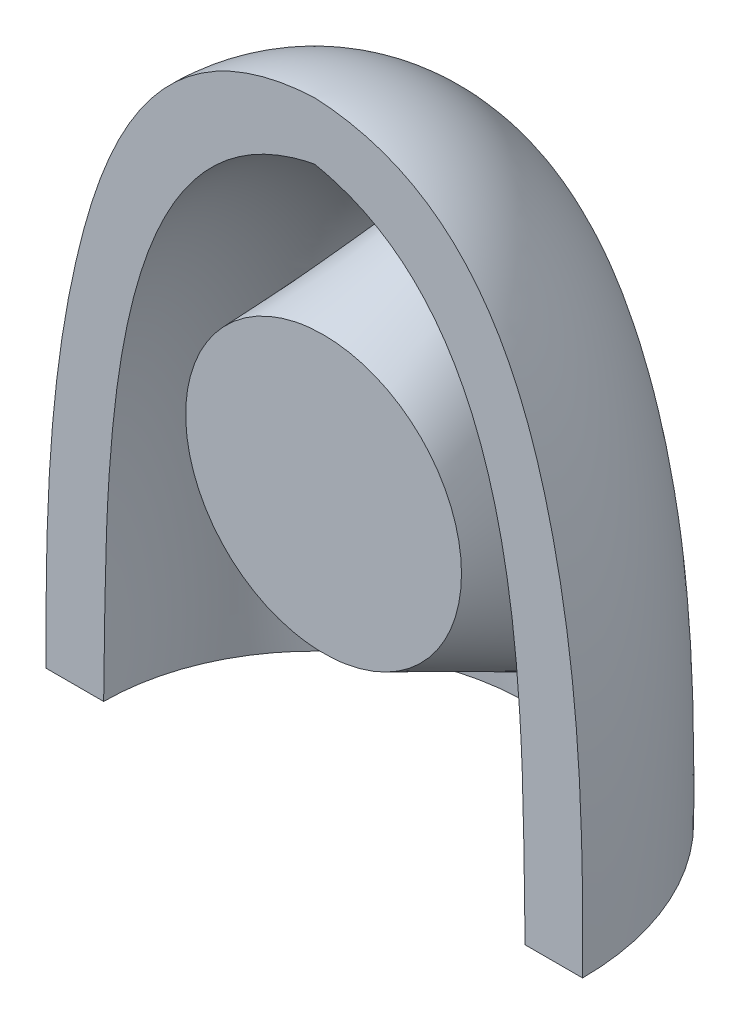
ISO-10303-21;
HEADER;
FILE_DESCRIPTION(('STEP AP214'),'2;1');
FILE_NAME('part.step','',(''),(''),'','','');
FILE_SCHEMA(('AUTOMOTIVE_DESIGN { 1 0 10303 214 1 1 1 1 }'));
ENDSEC;
DATA;
#1=APPLICATION_CONTEXT('core data for automotive mechanical design processes');
#2=APPLICATION_PROTOCOL_DEFINITION('international standard','automotive_design',2000,#1);
#3=PRODUCT_CONTEXT('',#1,'mechanical');
#4=PRODUCT('Part','Part','',(#3));
#5=PRODUCT_RELATED_PRODUCT_CATEGORY('part','',(#4));
#6=PRODUCT_DEFINITION_FORMATION('','',#4);
#7=PRODUCT_DEFINITION_CONTEXT('part definition',#1,'design');
#8=PRODUCT_DEFINITION('design','',#6,#7);
#9=PRODUCT_DEFINITION_SHAPE('','',#8);
#10=(LENGTH_UNIT() NAMED_UNIT(*) SI_UNIT(.MILLI.,.METRE.));
#11=(NAMED_UNIT(*) PLANE_ANGLE_UNIT() SI_UNIT($,.RADIAN.));
#12=(NAMED_UNIT(*) SI_UNIT($,.STERADIAN.) SOLID_ANGLE_UNIT());
#13=UNCERTAINTY_MEASURE_WITH_UNIT(LENGTH_MEASURE(1.E-05),#10,'distance_accuracy_value','');
#14=(GEOMETRIC_REPRESENTATION_CONTEXT(3) GLOBAL_UNCERTAINTY_ASSIGNED_CONTEXT((#13)) GLOBAL_UNIT_ASSIGNED_CONTEXT((#10,
#11,#12)) REPRESENTATION_CONTEXT('',''));
#15=CARTESIAN_POINT('',(0.,0.,0.));
#16=DIRECTION('',(0.,0.,1.));
#17=DIRECTION('',(1.,0.,0.));
#18=AXIS2_PLACEMENT_3D('',#15,#16,#17);
#19=CARTESIAN_POINT('',(0.,13.6694,0.));
#20=CARTESIAN_POINT('',(-3.38206675982998,13.5110575851413,0.));
#21=CARTESIAN_POINT('',(-5.75024953585605,7.93126514190041,0.));
#22=CARTESIAN_POINT('',(-5.84960889358613,2.68237857200598,0.));
#23=CARTESIAN_POINT('',(-5.8345,0.,0.));
#24=B_SPLINE_CURVE_WITH_KNOTS('',3,(#19,#20,#21,#22,#23),.UNSPECIFIED.,.F.,.F.,(4,1,4),(0.,
0.512022228256367,1.),.UNSPECIFIED.);
#25=CARTESIAN_POINT('',(0.,13.6694,0.));
#26=DIRECTION('',(0.,1.,0.));
#27=AXIS1_PLACEMENT('',#25,#26);
#28=SURFACE_OF_REVOLUTION('',#24,#27);
#29=CARTESIAN_POINT('',(0.,13.6694,0.));
#30=CARTESIAN_POINT('',(-3.38206675982998,13.5110575851413,0.));
#31=CARTESIAN_POINT('',(-5.75024953585605,7.93126514190041,0.));
#32=CARTESIAN_POINT('',(-5.84960889358613,2.68237857200598,0.));
#33=CARTESIAN_POINT('',(-5.8345,0.,0.));
#34=B_SPLINE_CURVE_WITH_KNOTS('',3,(#29,#30,#31,#32,#33),.UNSPECIFIED.,.F.,.F.,(4,1,4),(0.,
0.512022228256367,1.),.UNSPECIFIED.);
#35=CARTESIAN_POINT('',(-5.8345,0.,0.));
#36=VERTEX_POINT('',#35);
#37=CARTESIAN_POINT('',(0.,13.6694,0.));
#38=VERTEX_POINT('',#37);
#39=EDGE_CURVE('E126',#36,#38,#34,.F.);
#40=ORIENTED_EDGE('',*,*,#39,.T.);
#41=CARTESIAN_POINT('',(0.,13.6694,0.));
#42=CARTESIAN_POINT('',(3.38206675982998,13.5110575851413,0.));
#43=CARTESIAN_POINT('',(5.75024953585605,7.93126514190041,0.));
#44=CARTESIAN_POINT('',(5.84960889358613,2.68237857200598,0.));
#45=CARTESIAN_POINT('',(5.8345,0.,0.));
#46=B_SPLINE_CURVE_WITH_KNOTS('',3,(#41,#42,#43,#44,#45),.UNSPECIFIED.,.F.,.F.,(4,1,4),(0.,
0.512022228256367,1.),.UNSPECIFIED.);
#47=CARTESIAN_POINT('',(5.8345,0.,0.));
#48=VERTEX_POINT('',#47);
#49=EDGE_CURVE('E68',#38,#48,#46,.T.);
#50=ORIENTED_EDGE('',*,*,#49,.T.);
#51=CARTESIAN_POINT('',(0.,0.,0.));
#52=DIRECTION('',(0.,1.,0.));
#53=DIRECTION('',(-1.,0.,0.));
#54=AXIS2_PLACEMENT_3D('',#51,#52,#53);
#55=CIRCLE('',#54,5.8345);
#56=EDGE_CURVE('E85',#48,#36,#55,.T.);
#57=ORIENTED_EDGE('',*,*,#56,.T.);
#58=EDGE_LOOP('',(#40,#50,#57));
#59=FACE_BOUND('',#58,.T.);
#60=ADVANCED_FACE('F42',(#59),#28,.F.);
#61=CARTESIAN_POINT('',(-4.58425,0.,0.));
#62=DIRECTION('',(0.,-1.,0.));
#63=DIRECTION('',(1.,0.,0.));
#64=AXIS2_PLACEMENT_3D('',#61,#62,#63);
#65=PLANE('',#64);
#66=ORIENTED_EDGE('',*,*,#56,.F.);
#67=DIRECTION('',(-1.,0.,0.));
#68=VECTOR('',#67,1.);
#69=CARTESIAN_POINT('',(-4.58425,0.,0.));
#70=LINE('',#69,#68);
#71=CARTESIAN_POINT('',(4.58425,0.,0.));
#72=VERTEX_POINT('',#71);
#73=EDGE_CURVE('E125',#48,#72,#70,.T.);
#74=ORIENTED_EDGE('',*,*,#73,.T.);
#75=CARTESIAN_POINT('',(0.,0.,0.));
#76=DIRECTION('',(0.,1.,0.));
#77=DIRECTION('',(-1.,0.,0.));
#78=AXIS2_PLACEMENT_3D('',#75,#76,#77);
#79=CIRCLE('',#78,4.58425);
#80=CARTESIAN_POINT('',(-4.58425,0.,0.));
#81=VERTEX_POINT('',#80);
#82=EDGE_CURVE('E88',#72,#81,#79,.T.);
#83=ORIENTED_EDGE('',*,*,#82,.T.);
#84=EDGE_CURVE('E62',#81,#36,#70,.T.);
#85=ORIENTED_EDGE('',*,*,#84,.T.);
#86=EDGE_LOOP('',(#66,#74,#83,#85));
#87=FACE_BOUND('',#86,.T.);
#88=ADVANCED_FACE('F116',(#87),#65,.T.);
#89=CARTESIAN_POINT('',(-4.58425,0.,0.));
#90=CARTESIAN_POINT('',(-4.50070337033119,4.05797697519729,0.));
#91=CARTESIAN_POINT('',(-4.81799605550578,11.4734233678391,0.));
#92=CARTESIAN_POINT('',(0.,12.41915,0.));
#93=B_SPLINE_CURVE_WITH_KNOTS('',3,(#89,#90,#91,#92),.UNSPECIFIED.,.F.,.F.,(4,4),(0.,1.),.UNSPECIFIED.);
#94=CARTESIAN_POINT('',(0.,13.6694,0.));
#95=DIRECTION('',(0.,1.,0.));
#96=AXIS1_PLACEMENT('',#94,#95);
#97=SURFACE_OF_REVOLUTION('',#93,#96);
#98=CARTESIAN_POINT('',(-0.00647694645150213,9.97583750787656,-3.16046320560851));
#99=CARTESIAN_POINT('',(-0.0535971992121935,9.97571345286075,-3.16043387049451));
#100=CARTESIAN_POINT('',(-0.100711517460668,9.97342244376014,-3.16052173639267));
#101=CARTESIAN_POINT('',(-0.194543409089378,9.96457424830817,-3.16092628845606));
#102=CARTESIAN_POINT('',(-0.241260814777164,9.9580153415638,-3.16124306690183));
#103=CARTESIAN_POINT('',(-0.380367862071051,9.93211814704855,-3.16251920914227));
#104=CARTESIAN_POINT('',(-0.471655634808407,9.90655979550584,-3.16380439009998));
#105=CARTESIAN_POINT('',(-0.648066138389105,9.84135080379048,-3.16703243694149));
#106=CARTESIAN_POINT('',(-0.733231163346773,9.80181090788802,-3.1689701288596));
#107=CARTESIAN_POINT('',(-0.897107028127798,9.71125365387065,-3.17327924583076));
#108=CARTESIAN_POINT('',(-0.975816902598135,9.66023458332661,-3.17565073558661));
#109=CARTESIAN_POINT('',(-1.17651808362355,9.51225114991119,-3.18228269100995));
#110=CARTESIAN_POINT('',(-1.29260008983055,9.40725375890066,-3.18675298135184));
#111=CARTESIAN_POINT('',(-1.45346612691112,9.23743603852461,-3.19357917130015));
#112=CARTESIAN_POINT('',(-1.50498167972006,9.17862705459679,-3.19588012273656));
#113=CARTESIAN_POINT('',(-1.60383636043855,9.05759100728039,-3.20051708130899));
#114=CARTESIAN_POINT('',(-1.65117635337971,8.99536465620689,-3.20285308106632));
#115=CARTESIAN_POINT('',(-1.77067767706076,8.8277942509198,-3.20906408810617));
#116=CARTESIAN_POINT('',(-1.83955915304991,8.72011362072076,-3.21297634249599));
#117=CARTESIAN_POINT('',(-1.9676631760318,8.49949020025351,-3.22109728274303));
#118=CARTESIAN_POINT('',(-2.02690256420807,8.38655703779447,-3.22530543295562));
#119=CARTESIAN_POINT('',(-2.1367670520014,8.15630538058518,-3.23434525429702));
#120=CARTESIAN_POINT('',(-2.18737231362893,8.03897752252485,-3.2391783176576));
#121=CARTESIAN_POINT('',(-2.28036467195709,7.80114585929809,-3.2498465723563));
#122=CARTESIAN_POINT('',(-2.32274973958351,7.68064127830596,-3.25568201045217));
#123=CARTESIAN_POINT('',(-2.41457894994005,7.39009334050736,-3.27130988798555));
#124=CARTESIAN_POINT('',(-2.46040324861829,7.21893267631692,-3.28175963788603));
#125=CARTESIAN_POINT('',(-2.53763556461972,6.8736710280602,-3.30643206487547));
#126=CARTESIAN_POINT('',(-2.56904193422094,6.69956971028376,-3.32065517290159));
#127=CARTESIAN_POINT('',(-2.61792270644143,6.34993842921601,-3.35359315195262));
#128=CARTESIAN_POINT('',(-2.63540395622698,6.17440921098969,-3.37230580950916));
#129=CARTESIAN_POINT('',(-2.65697986343638,5.82312624204429,-3.41448401370955));
#130=CARTESIAN_POINT('',(-2.66107532264982,5.64737250540443,-3.43794927558982));
#131=CARTESIAN_POINT('',(-2.65644695068934,5.29467289775676,-3.48972369118675));
#132=CARTESIAN_POINT('',(-2.64757325821004,5.11773698329391,-3.51808607841144));
#133=CARTESIAN_POINT('',(-2.61734056906186,4.76563393925425,-3.57888823024791));
#134=CARTESIAN_POINT('',(-2.59597998346709,4.59046703766608,-3.6113285133493));
#135=CARTESIAN_POINT('',(-2.54120280085091,4.24244385987256,-3.6795633163593));
#136=CARTESIAN_POINT('',(-2.507769526046,4.06959112482989,-3.71536242542177));
#137=CARTESIAN_POINT('',(-2.42904993051788,3.72717648742094,-3.789444715778));
#138=CARTESIAN_POINT('',(-2.38376598793782,3.55761393211993,-3.82772739752069));
#139=CARTESIAN_POINT('',(-2.29205076903914,3.25824657645713,-3.89762717521229));
#140=CARTESIAN_POINT('',(-2.24791524169865,3.12766130207067,-3.92892866571745));
#141=CARTESIAN_POINT('',(-2.1518221741081,2.86956252895935,-3.99215494633978));
#142=CARTESIAN_POINT('',(-2.09986586734519,2.74204854950466,-4.02407963747642));
#143=CARTESIAN_POINT('',(-1.98766119603779,2.49112094070578,-4.08804628717812));
#144=CARTESIAN_POINT('',(-1.92743348914256,2.36769801861112,-4.12008776584122));
#145=CARTESIAN_POINT('',(-1.7976909532402,2.12581362259867,-4.18383868674504));
#146=CARTESIAN_POINT('',(-1.72818197956173,2.00734908194573,-4.215548324845));
#147=CARTESIAN_POINT('',(-1.57988748252861,1.77924275321167,-4.27739294630887));
#148=CARTESIAN_POINT('',(-1.50130950746733,1.66947388883947,-4.30754658417618));
#149=CARTESIAN_POINT('',(-1.37433961983464,1.51170703052448,-4.35134841451237));
#150=CARTESIAN_POINT('',(-1.33048336972409,1.46025014941261,-4.36571537552383));
#151=CARTESIAN_POINT('',(-1.23944967705522,1.36018289155759,-4.39379304292888));
#152=CARTESIAN_POINT('',(-1.19227283189904,1.31157200566468,-4.40750386662509));
#153=CARTESIAN_POINT('',(-1.06499162243353,1.18981568892957,-4.44200065930796));
#154=CARTESIAN_POINT('',(-0.982056794239717,1.11936711814992,-4.46211866167006));
#155=CARTESIAN_POINT('',(-0.805929560421351,0.991538503653242,-4.49882861321766));
#156=CARTESIAN_POINT('',(-0.712762277176248,0.934127469609536,-4.5154289175762));
#157=CARTESIAN_POINT('',(-0.546571140365152,0.852983794149452,-4.53897412211844));
#158=CARTESIAN_POINT('',(-0.476178855861206,0.824324336254852,-4.5473181533602));
#159=CARTESIAN_POINT('',(-0.331477242013398,0.7783497442375,-4.56071666854243));
#160=CARTESIAN_POINT('',(-0.257173052945138,0.761020105727461,-4.565775358308));
#161=CARTESIAN_POINT('',(-0.105961098455323,0.739428468883715,-4.57206167212212));
#162=CARTESIAN_POINT('',(-0.0290391720275589,0.735255237095044,-4.57326327330002));
#163=CARTESIAN_POINT('',(0.124272677316161,0.740753056812626,-4.57159811038367));
#164=CARTESIAN_POINT('',(0.200662448923073,0.750427896300345,-4.56873023313201));
#165=CARTESIAN_POINT('',(0.344008705029883,0.781080522371735,-4.55969683921538));
#166=CARTESIAN_POINT('',(0.411213958035242,0.801023513402857,-4.55383355389053));
#167=CARTESIAN_POINT('',(0.541946594835622,0.84986463037173,-4.5395263304305));
#168=CARTESIAN_POINT('',(0.605472606187228,0.878766072810675,-4.53108143657604));
#169=CARTESIAN_POINT('',(0.769267810162406,0.965424629304089,-4.50586011987154));
#170=CARTESIAN_POINT('',(0.865854275040455,1.02958497270765,-4.48727924167637));
#171=CARTESIAN_POINT('',(1.04789155142864,1.17140433780689,-4.446537335469));
#172=CARTESIAN_POINT('',(1.13329284841187,1.24912005012554,-4.42436130058937));
#173=CARTESIAN_POINT('',(1.28625276916553,1.40563043796409,-4.38010111903011));
#174=CARTESIAN_POINT('',(1.35473843801501,1.48359115466346,-4.35821621115682));
#175=CARTESIAN_POINT('',(1.48443173773946,1.64476989464967,-4.31337148817776));
#176=CARTESIAN_POINT('',(1.54565152810224,1.72797876716442,-4.2904135611735));
#177=CARTESIAN_POINT('',(1.66193849582133,1.8986408893028,-4.24378704048966));
#178=CARTESIAN_POINT('',(1.716992207619,1.98610285210631,-4.22011702934556));
#179=CARTESIAN_POINT('',(1.82147921828737,2.16424553641966,-4.17243178789007));
#180=CARTESIAN_POINT('',(1.87091056915067,2.25492735933749,-4.14841644115519));
#181=CARTESIAN_POINT('',(2.00246405884877,2.51301358918131,-4.08090338054682));
#182=CARTESIAN_POINT('',(2.07882200736485,2.68334536429005,-4.03730435005343));
#183=CARTESIAN_POINT('',(2.21670772670646,3.02971401547691,-3.95109480984479));
#184=CARTESIAN_POINT('',(2.27825917786758,3.20574126410642,-3.90848282152661));
#185=CARTESIAN_POINT('',(2.38758264993758,3.5622548516247,-3.82521835202292));
#186=CARTESIAN_POINT('',(2.43536915452287,3.74273628498228,-3.7845638489467));
#187=CARTESIAN_POINT('',(2.51753965206704,4.10758025872685,-3.7061189754683));
#188=CARTESIAN_POINT('',(2.5519068238121,4.29194736682321,-3.66833224730877));
#189=CARTESIAN_POINT('',(2.6072609723051,4.66601411509834,-3.59619226117093));
#190=CARTESIAN_POINT('',(2.62805979268111,4.85575217335481,-3.56189263418428));
#191=CARTESIAN_POINT('',(2.65490353009215,5.23717913970195,-3.49825252827537));
#192=CARTESIAN_POINT('',(2.66094377849239,5.42886864585085,-3.46891362132752));
#193=CARTESIAN_POINT('',(2.65748477866674,5.81302634562349,-3.41581522368615));
#194=CARTESIAN_POINT('',(2.64797534255435,6.00549496728287,-3.39205940259959));
#195=CARTESIAN_POINT('',(2.61267557150272,6.38952024172938,-3.35021555114836));
#196=CARTESIAN_POINT('',(2.58689077339807,6.58107718234755,-3.33212559640131));
#197=CARTESIAN_POINT('',(2.52639632040854,6.91726686163726,-3.30457879016357));
#198=CARTESIAN_POINT('',(2.49515863834917,7.06244834835685,-3.29409258474213));
#199=CARTESIAN_POINT('',(2.42242331289994,7.35040899846807,-3.2755262463682));
#200=CARTESIAN_POINT('',(2.38092449529725,7.49318788492433,-3.26744638901483));
#201=CARTESIAN_POINT('',(2.28730206870908,7.77510457093348,-3.25306355060775));
#202=CARTESIAN_POINT('',(2.23519400583947,7.91424736575832,-3.24675800143638));
#203=CARTESIAN_POINT('',(2.11968955067831,8.1877324881972,-3.23525889476599));
#204=CARTESIAN_POINT('',(2.0562993256164,8.32207739057829,-3.23006473314215));
#205=CARTESIAN_POINT('',(1.9067268511058,8.60406063392545,-3.21947087143365));
#206=CARTESIAN_POINT('',(1.81855286187531,8.75067581342697,-3.21415692954167));
#207=CARTESIAN_POINT('',(1.6725239158713,8.960937586312,-3.20631507227638));
#208=CARTESIAN_POINT('',(1.62156453327483,9.02940192224996,-3.20372313572436));
#209=CARTESIAN_POINT('',(1.51471436514371,9.16235630945873,-3.19856498142123));
#210=CARTESIAN_POINT('',(1.45882492834379,9.2268474395459,-3.19599875684861));
#211=CARTESIAN_POINT('',(1.31357327620093,9.38082355406213,-3.18967301504508));
#212=CARTESIAN_POINT('',(1.2210499188998,9.46739410461549,-3.18593379046539));
#213=CARTESIAN_POINT('',(1.02374301148259,9.6253435307747,-3.17876211891951));
#214=CARTESIAN_POINT('',(0.918978401126993,9.69674540543037,-3.17532921215901));
#215=CARTESIAN_POINT('',(0.7254136096577,9.80338522355589,-3.1699846108012));
#216=CARTESIAN_POINT('',(0.639155537708505,9.84320133572967,-3.16790709217564));
#217=CARTESIAN_POINT('',(0.461356552522961,9.90825865966878,-3.16442307444729));
#218=CARTESIAN_POINT('',(0.36982902160303,9.93353514327863,-3.16301495290096));
#219=CARTESIAN_POINT('',(0.23014707965961,9.95899141371237,-3.16155057964691));
#220=CARTESIAN_POINT('',(0.183070217066758,9.9654007171861,-3.16117029368475));
#221=CARTESIAN_POINT('',(0.0885013116766709,9.97388680921449,-3.16064135945882));
#222=CARTESIAN_POINT('',(0.0410091690993739,9.97596252611119,-3.1604927684935));
#223=CARTESIAN_POINT('',(-0.00647694645150213,9.97583750787656,-3.16046320560851));
#224=B_SPLINE_CURVE_WITH_KNOTS('',3,(#98,#99,#100,#101,#102,#103,#104,#105,#106,#107,#108,#109,
#110,#111,#112,#113,#114,#115,#116,#117,#118,#119,#120,#121,#122,#123,#124,#125,#126,#127,#128,
#129,#130,#131,#132,#133,#134,#135,#136,#137,#138,#139,#140,#141,#142,#143,#144,#145,#146,#147,
#148,#149,#150,#151,#152,#153,#154,#155,#156,#157,#158,#159,#160,#161,#162,#163,#164,#165,#166,
#167,#168,#169,#170,#171,#172,#173,#174,#175,#176,#177,#178,#179,#180,#181,#182,#183,#184,#185,
#186,#187,#188,#189,#190,#191,#192,#193,#194,#195,#196,#197,#198,#199,#200,#201,#202,#203,#204,
#205,#206,#207,#208,#209,#210,#211,#212,#213,#214,#215,#216,#217,#218,#219,#220,#221,#222,#223),
.UNSPECIFIED.,.T.,.F.,(4,2,2,2,2,2,2,2,2,2,2,2,2,2,2,2,2,2,2,2,2,2,2,2,2,2,2,2,2,2,2,2,2,2,2,2,
2,2,2,2,2,2,2,2,2,2,2,2,2,2,2,2,2,2,2,2,2,2,2,2,2,2,4),(0.,0.141306857183157,0.282670710591442,
0.565566036468953,0.84626904199712,1.12701394976105,1.59392245730513,1.82845742381032,
2.06294368809887,2.4460142066409,2.82840829020601,3.21166947420574,3.59502514239374,
4.12679508125588,4.65862577718055,5.1901948031875,5.72173198839093,6.25945996539763,
6.79725638184267,7.33579859588184,7.87423282025307,8.29806278501227,8.72182597354939,
9.1445494429373,9.56700747525641,9.98121965488371,10.1884610576073,10.395665270745,
10.7266854893974,11.0569104366549,11.2854480530215,11.5136925205957,11.7434736983542,
11.973317742138,12.1835514905262,12.3938631625291,12.7441384128193,13.0959153188493,
13.4136118639147,13.7307690126674,14.0486057975583,14.3665523716336,14.9407678111135,
15.5140586977103,16.0867441372048,16.6601451543077,17.2413375821944,17.8227138370868,
18.4044711523702,18.9860306619621,19.4322910094872,19.8786024475889,20.3242645361748,
20.7696837541358,21.2818236905049,21.5377910663334,21.7936886320369,22.1727816074869,
22.551295626157,22.8353327674979,23.1186779220789,23.261046746726,23.4034507737674),.UNSPECIFIED.);
#225=CARTESIAN_POINT('',(-0.00647694645150213,9.97583750787656,-3.16046320560851));
#226=VERTEX_POINT('',#225);
#227=EDGE_CURVE('E12',#226,#226,#224,.T.);
#228=ORIENTED_EDGE('',*,*,#227,.F.);
#229=EDGE_LOOP('',(#228));
#230=FACE_BOUND('',#229,.T.);
#231=ORIENTED_EDGE('',*,*,#82,.F.);
#232=CARTESIAN_POINT('',(4.58425,0.,0.));
#233=CARTESIAN_POINT('',(4.50070337033119,4.05797697519729,0.));
#234=CARTESIAN_POINT('',(4.81799605550578,11.4734233678391,0.));
#235=CARTESIAN_POINT('',(0.,12.41915,0.));
#236=B_SPLINE_CURVE_WITH_KNOTS('',3,(#232,#233,#234,#235),.UNSPECIFIED.,.F.,.F.,(4,4),(0.,1.),.UNSPECIFIED.);
#237=CARTESIAN_POINT('',(0.,12.41915,0.));
#238=VERTEX_POINT('',#237);
#239=EDGE_CURVE('E55',#72,#238,#236,.T.);
#240=ORIENTED_EDGE('',*,*,#239,.T.);
#241=CARTESIAN_POINT('',(-4.58425,0.,0.));
#242=CARTESIAN_POINT('',(-4.50070337033119,4.05797697519729,0.));
#243=CARTESIAN_POINT('',(-4.81799605550578,11.4734233678391,0.));
#244=CARTESIAN_POINT('',(0.,12.41915,0.));
#245=B_SPLINE_CURVE_WITH_KNOTS('',3,(#241,#242,#243,#244),.UNSPECIFIED.,.F.,.F.,(4,4),(0.,1.),.UNSPECIFIED.);
#246=EDGE_CURVE('E78',#238,#81,#245,.F.);
#247=ORIENTED_EDGE('',*,*,#246,.T.);
#248=EDGE_LOOP('',(#231,#240,#247));
#249=FACE_BOUND('',#248,.T.);
#250=ADVANCED_FACE('F87',(#230,#249),#97,.F.);
#251=CARTESIAN_POINT('',(0.,0.,0.));
#252=DIRECTION('',(0.,0.,1.));
#253=DIRECTION('',(1.,0.,0.));
#254=AXIS2_PLACEMENT_3D('',#251,#252,#253);
#255=PLANE('',#254);
#256=ORIENTED_EDGE('',*,*,#39,.F.);
#257=ORIENTED_EDGE('',*,*,#84,.F.);
#258=ORIENTED_EDGE('',*,*,#246,.F.);
#259=ORIENTED_EDGE('',*,*,#239,.F.);
#260=ORIENTED_EDGE('',*,*,#73,.F.);
#261=ORIENTED_EDGE('',*,*,#49,.F.);
#262=EDGE_LOOP('',(#256,#257,#258,#259,#260,#261));
#263=FACE_BOUND('',#262,.T.);
#264=ADVANCED_FACE('F80',(#263),#255,.T.);
#265=CARTESIAN_POINT('',(0.,6.1,-0.2));
#266=DIRECTION('',(0.,0.,1.));
#267=DIRECTION('',(1.,0.,0.));
#268=AXIS2_PLACEMENT_3D('',#265,#266,#267);
#269=PLANE('',#268);
#270=CARTESIAN_POINT('',(0.,6.1,-0.2));
#271=DIRECTION('',(0.,0.,1.));
#272=DIRECTION('',(1.,0.,0.));
#273=AXIS2_PLACEMENT_3D('',#270,#271,#272);
#274=CIRCLE('',#273,3.);
#275=CARTESIAN_POINT('',(3.,6.1,-0.2));
#276=VERTEX_POINT('',#275);
#277=EDGE_CURVE('E140',#276,#276,#274,.T.);
#278=ORIENTED_EDGE('',*,*,#277,.T.);
#279=EDGE_LOOP('',(#278));
#280=FACE_BOUND('',#279,.T.);
#281=ADVANCED_FACE('F150',(#280),#269,.T.);
#282=CARTESIAN_POINT('',(-0.0221814320131744,9.09991799622487,-0.2));
#283=CARTESIAN_POINT('',(0.,10.3370899507226,-4.38143676625586));
#284=CARTESIAN_POINT('',(5.97765456043657,9.14428086025122,-0.2));
#285=CARTESIAN_POINT('',(4.99443575329415,10.3370899507226,-4.38143676625586));
#286=CARTESIAN_POINT('',(6.02201742446292,3.14444486780148,-0.2));
#287=CARTESIAN_POINT('',(4.99443575329415,0.165652318584721,-5.63033226966919));
#288=CARTESIAN_POINT('',(0.0221814320131741,3.10008200377513,-0.2));
#289=CARTESIAN_POINT('',(0.,0.165652318584722,-5.63033226966919));
#290=CARTESIAN_POINT('',(-5.97765456043657,3.05571913974878,-0.2));
#291=CARTESIAN_POINT('',(-4.99443575329415,0.165652318584724,-5.63033226966919));
#292=CARTESIAN_POINT('',(-6.02201742446292,9.05555513219852,-0.2));
#293=CARTESIAN_POINT('',(-4.99443575329415,10.3370899507226,-4.38143676625586));
#294=CARTESIAN_POINT('',(-0.0221814320131744,9.09991799622487,-0.2));
#295=CARTESIAN_POINT('',(0.,10.3370899507226,-4.38143676625586));
#296=(BOUNDED_SURFACE() B_SPLINE_SURFACE(3,1,((#282,#283),(#284,#285),(#286,#287),(#288,#289),
(#290,#291),(#292,#293),(#294,#295)),.UNSPECIFIED.,.T.,.F.,.F.) B_SPLINE_SURFACE_WITH_KNOTS((4,
3,4),(2,2),(0.,0.5,1.),(0.,1.),
.UNSPECIFIED.) GEOMETRIC_REPRESENTATION_ITEM() RATIONAL_B_SPLINE_SURFACE(((1.,1.),
(0.333333333333333,0.333333333333333),(0.333333333333333,0.333333333333333),(1.,1.),
(0.333333333333333,0.333333333333333),(0.333333333333333,0.333333333333333),(1.,1.))) REPRESENTATION_ITEM('') SURFACE());
#297=ORIENTED_EDGE('',*,*,#227,.T.);
#298=EDGE_LOOP('',(#297));
#299=FACE_BOUND('',#298,.T.);
#300=ORIENTED_EDGE('',*,*,#277,.F.);
#301=EDGE_LOOP('',(#300));
#302=FACE_BOUND('',#301,.T.);
#303=ADVANCED_FACE('F158',(#299,#302),#296,.T.);
#304=CLOSED_SHELL('',(#60,#88,#250,#264,#281,#303));
#305=MANIFOLD_SOLID_BREP('B2',#304);
#306=ADVANCED_BREP_SHAPE_REPRESENTATION('',(#18,#305),#14);
#307=SHAPE_DEFINITION_REPRESENTATION(#9,#306);
ENDSEC;
END-ISO-10303-21;
